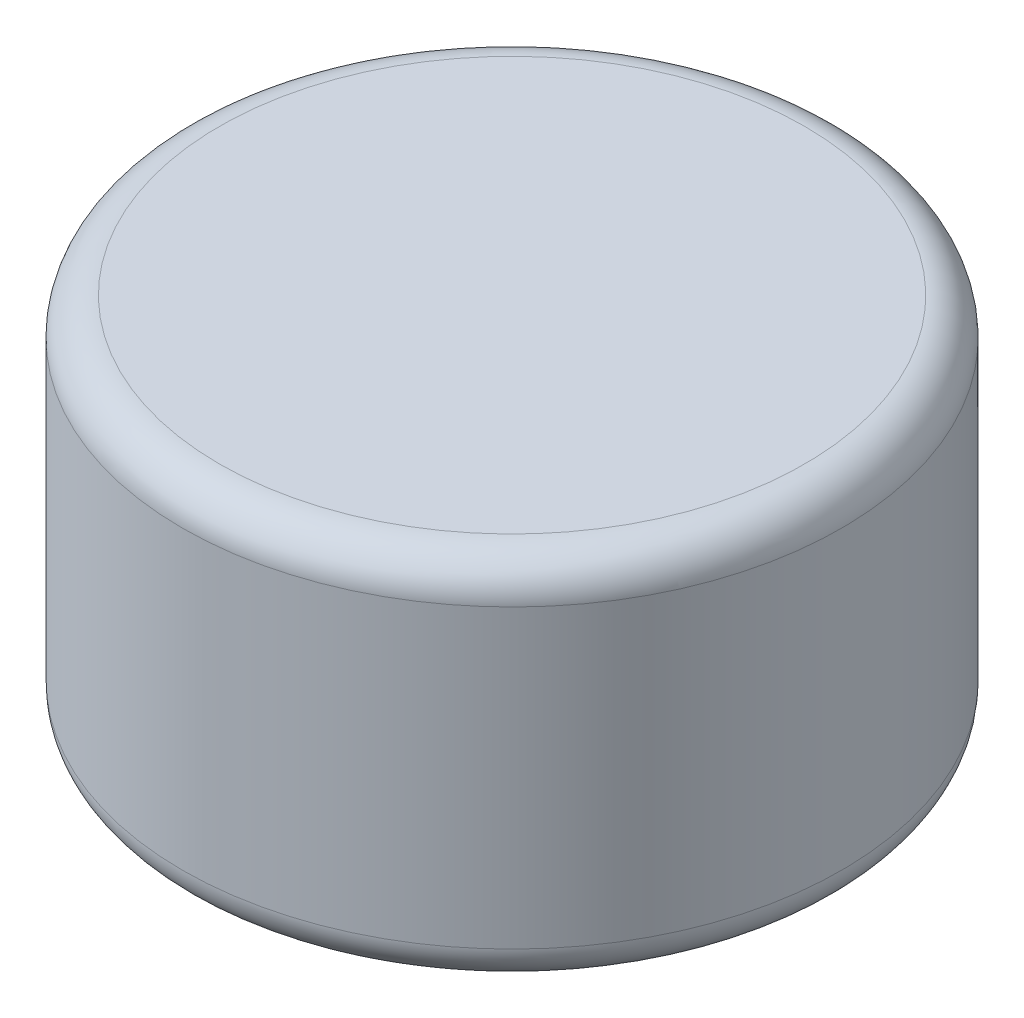
ISO-10303-21;
HEADER;
FILE_DESCRIPTION(('STEP AP214'),'2;1');
FILE_NAME('part.step','',(''),(''),'','','');
FILE_SCHEMA(('AUTOMOTIVE_DESIGN { 1 0 10303 214 1 1 1 1 }'));
ENDSEC;
DATA;
#1=APPLICATION_CONTEXT('core data for automotive mechanical design processes');
#2=APPLICATION_PROTOCOL_DEFINITION('international standard','automotive_design',2000,#1);
#3=PRODUCT_CONTEXT('',#1,'mechanical');
#4=PRODUCT('Part','Part','',(#3));
#5=PRODUCT_RELATED_PRODUCT_CATEGORY('part','',(#4));
#6=PRODUCT_DEFINITION_FORMATION('','',#4);
#7=PRODUCT_DEFINITION_CONTEXT('part definition',#1,'design');
#8=PRODUCT_DEFINITION('design','',#6,#7);
#9=PRODUCT_DEFINITION_SHAPE('','',#8);
#10=(LENGTH_UNIT() NAMED_UNIT(*) SI_UNIT(.MILLI.,.METRE.));
#11=(NAMED_UNIT(*) PLANE_ANGLE_UNIT() SI_UNIT($,.RADIAN.));
#12=(NAMED_UNIT(*) SI_UNIT($,.STERADIAN.) SOLID_ANGLE_UNIT());
#13=UNCERTAINTY_MEASURE_WITH_UNIT(LENGTH_MEASURE(1.E-05),#10,'distance_accuracy_value','');
#14=(GEOMETRIC_REPRESENTATION_CONTEXT(3) GLOBAL_UNCERTAINTY_ASSIGNED_CONTEXT((#13)) GLOBAL_UNIT_ASSIGNED_CONTEXT((#10,
#11,#12)) REPRESENTATION_CONTEXT('',''));
#15=CARTESIAN_POINT('',(0.,0.,0.));
#16=DIRECTION('',(0.,0.,1.));
#17=DIRECTION('',(1.,0.,0.));
#18=AXIS2_PLACEMENT_3D('',#15,#16,#17);
#19=CARTESIAN_POINT('',(0.,25.,0.));
#20=DIRECTION('',(0.,-1.,0.));
#21=DIRECTION('',(0.,0.,-1.));
#22=AXIS2_PLACEMENT_3D('',#19,#20,#21);
#23=CYLINDRICAL_SURFACE('',#22,44.5);
#24=CARTESIAN_POINT('',(0.,-20.,0.));
#25=DIRECTION('',(0.,1.,0.));
#26=DIRECTION('',(0.,0.,1.));
#27=AXIS2_PLACEMENT_3D('',#24,#25,#26);
#28=CIRCLE('',#27,44.5);
#29=CARTESIAN_POINT('',(0.,-20.,44.5));
#30=VERTEX_POINT('',#29);
#31=EDGE_CURVE('E53',#30,#30,#28,.T.);
#32=ORIENTED_EDGE('',*,*,#31,.T.);
#33=EDGE_LOOP('',(#32));
#34=FACE_BOUND('',#33,.T.);
#35=CARTESIAN_POINT('',(0.,20.,0.));
#36=DIRECTION('',(0.,1.,0.));
#37=DIRECTION('',(0.,0.,1.));
#38=AXIS2_PLACEMENT_3D('',#35,#36,#37);
#39=CIRCLE('',#38,44.5);
#40=CARTESIAN_POINT('',(0.,20.,44.5));
#41=VERTEX_POINT('',#40);
#42=EDGE_CURVE('E58',#41,#41,#39,.F.);
#43=ORIENTED_EDGE('',*,*,#42,.T.);
#44=EDGE_LOOP('',(#43));
#45=FACE_BOUND('',#44,.T.);
#46=ADVANCED_FACE('F40',(#34,#45),#23,.T.);
#47=CARTESIAN_POINT('',(0.,25.,0.));
#48=DIRECTION('',(0.,1.,0.));
#49=DIRECTION('',(0.,0.,1.));
#50=AXIS2_PLACEMENT_3D('',#47,#48,#49);
#51=PLANE('',#50);
#52=CARTESIAN_POINT('',(0.,25.,0.));
#53=DIRECTION('',(0.,1.,0.));
#54=DIRECTION('',(0.,0.,1.));
#55=AXIS2_PLACEMENT_3D('',#52,#53,#54);
#56=CIRCLE('',#55,39.5);
#57=CARTESIAN_POINT('',(0.,25.,39.5));
#58=VERTEX_POINT('',#57);
#59=EDGE_CURVE('E10',#58,#58,#56,.T.);
#60=ORIENTED_EDGE('',*,*,#59,.T.);
#61=EDGE_LOOP('',(#60));
#62=FACE_BOUND('',#61,.T.);
#63=ADVANCED_FACE('F91',(#62),#51,.T.);
#64=CARTESIAN_POINT('',(0.,-25.,0.));
#65=DIRECTION('',(0.,1.,0.));
#66=DIRECTION('',(0.,0.,1.));
#67=AXIS2_PLACEMENT_3D('',#64,#65,#66);
#68=PLANE('',#67);
#69=CARTESIAN_POINT('',(0.,-25.,0.));
#70=DIRECTION('',(0.,1.,0.));
#71=DIRECTION('',(0.,0.,1.));
#72=AXIS2_PLACEMENT_3D('',#69,#70,#71);
#73=CIRCLE('',#72,39.5);
#74=CARTESIAN_POINT('',(0.,-25.,39.5));
#75=VERTEX_POINT('',#74);
#76=EDGE_CURVE('E48',#75,#75,#73,.F.);
#77=ORIENTED_EDGE('',*,*,#76,.T.);
#78=EDGE_LOOP('',(#77));
#79=FACE_BOUND('',#78,.T.);
#80=ADVANCED_FACE('F94',(#79),#68,.F.);
#81=CARTESIAN_POINT('',(0.,-20.,0.));
#82=DIRECTION('',(0.,1.,0.));
#83=DIRECTION('',(0.,0.,1.));
#84=AXIS2_PLACEMENT_3D('',#81,#82,#83);
#85=TOROIDAL_SURFACE('',#84,39.5,5.);
#86=ORIENTED_EDGE('',*,*,#76,.F.);
#87=EDGE_LOOP('',(#86));
#88=FACE_BOUND('',#87,.T.);
#89=ORIENTED_EDGE('',*,*,#31,.F.);
#90=EDGE_LOOP('',(#89));
#91=FACE_BOUND('',#90,.T.);
#92=ADVANCED_FACE('F97',(#88,#91),#85,.T.);
#93=CARTESIAN_POINT('',(0.,20.,0.));
#94=DIRECTION('',(0.,1.,0.));
#95=DIRECTION('',(0.,0.,1.));
#96=AXIS2_PLACEMENT_3D('',#93,#94,#95);
#97=TOROIDAL_SURFACE('',#96,39.5,5.);
#98=ORIENTED_EDGE('',*,*,#42,.F.);
#99=EDGE_LOOP('',(#98));
#100=FACE_BOUND('',#99,.T.);
#101=ORIENTED_EDGE('',*,*,#59,.F.);
#102=EDGE_LOOP('',(#101));
#103=FACE_BOUND('',#102,.T.);
#104=ADVANCED_FACE('F42',(#100,#103),#97,.T.);
#105=CLOSED_SHELL('',(#46,#63,#80,#92,#104));
#106=CARTESIAN_POINT('',(0.,-20.05,0.));
#107=DIRECTION('',(0.,1.,0.));
#108=DIRECTION('',(0.,0.,1.));
#109=AXIS2_PLACEMENT_3D('',#106,#107,#108);
#110=CYLINDRICAL_SURFACE('',#109,40.5);
#111=CARTESIAN_POINT('',(0.,-20.05,0.));
#112=DIRECTION('',(0.,1.,0.));
#113=DIRECTION('',(0.,0.,1.));
#114=AXIS2_PLACEMENT_3D('',#111,#112,#113);
#115=CIRCLE('',#114,40.5);
#116=CARTESIAN_POINT('',(0.,-20.05,40.5));
#117=VERTEX_POINT('',#116);
#118=EDGE_CURVE('E64',#117,#117,#115,.T.);
#119=ORIENTED_EDGE('',*,*,#118,.F.);
#120=EDGE_LOOP('',(#119));
#121=FACE_BOUND('',#120,.T.);
#122=CARTESIAN_POINT('',(0.,20.05,0.));
#123=DIRECTION('',(0.,1.,0.));
#124=DIRECTION('',(0.,0.,1.));
#125=AXIS2_PLACEMENT_3D('',#122,#123,#124);
#126=CIRCLE('',#125,40.5);
#127=CARTESIAN_POINT('',(0.,20.05,40.5));
#128=VERTEX_POINT('',#127);
#129=EDGE_CURVE('E65',#128,#128,#126,.T.);
#130=ORIENTED_EDGE('',*,*,#129,.T.);
#131=EDGE_LOOP('',(#130));
#132=FACE_BOUND('',#131,.T.);
#133=ADVANCED_FACE('F75',(#121,#132),#110,.F.);
#134=CARTESIAN_POINT('',(0.,-20.05,0.));
#135=DIRECTION('',(0.,1.,0.));
#136=DIRECTION('',(0.,0.,1.));
#137=AXIS2_PLACEMENT_3D('',#134,#135,#136);
#138=PLANE('',#137);
#139=ORIENTED_EDGE('',*,*,#118,.T.);
#140=EDGE_LOOP('',(#139));
#141=FACE_BOUND('',#140,.T.);
#142=ADVANCED_FACE('F73',(#141),#138,.T.);
#143=CARTESIAN_POINT('',(0.,20.05,0.));
#144=DIRECTION('',(0.,1.,0.));
#145=DIRECTION('',(0.,0.,1.));
#146=AXIS2_PLACEMENT_3D('',#143,#144,#145);
#147=PLANE('',#146);
#148=ORIENTED_EDGE('',*,*,#129,.F.);
#149=EDGE_LOOP('',(#148));
#150=FACE_BOUND('',#149,.T.);
#151=ADVANCED_FACE('F82',(#150),#147,.F.);
#152=CLOSED_SHELL('',(#133,#142,#151));
#153=ORIENTED_CLOSED_SHELL('',*,#152,.T.);
#154=BREP_WITH_VOIDS('B2',#105,(#153));
#155=ADVANCED_BREP_SHAPE_REPRESENTATION('',(#18,#154),#14);
#156=SHAPE_DEFINITION_REPRESENTATION(#9,#155);
ENDSEC;
END-ISO-10303-21;
